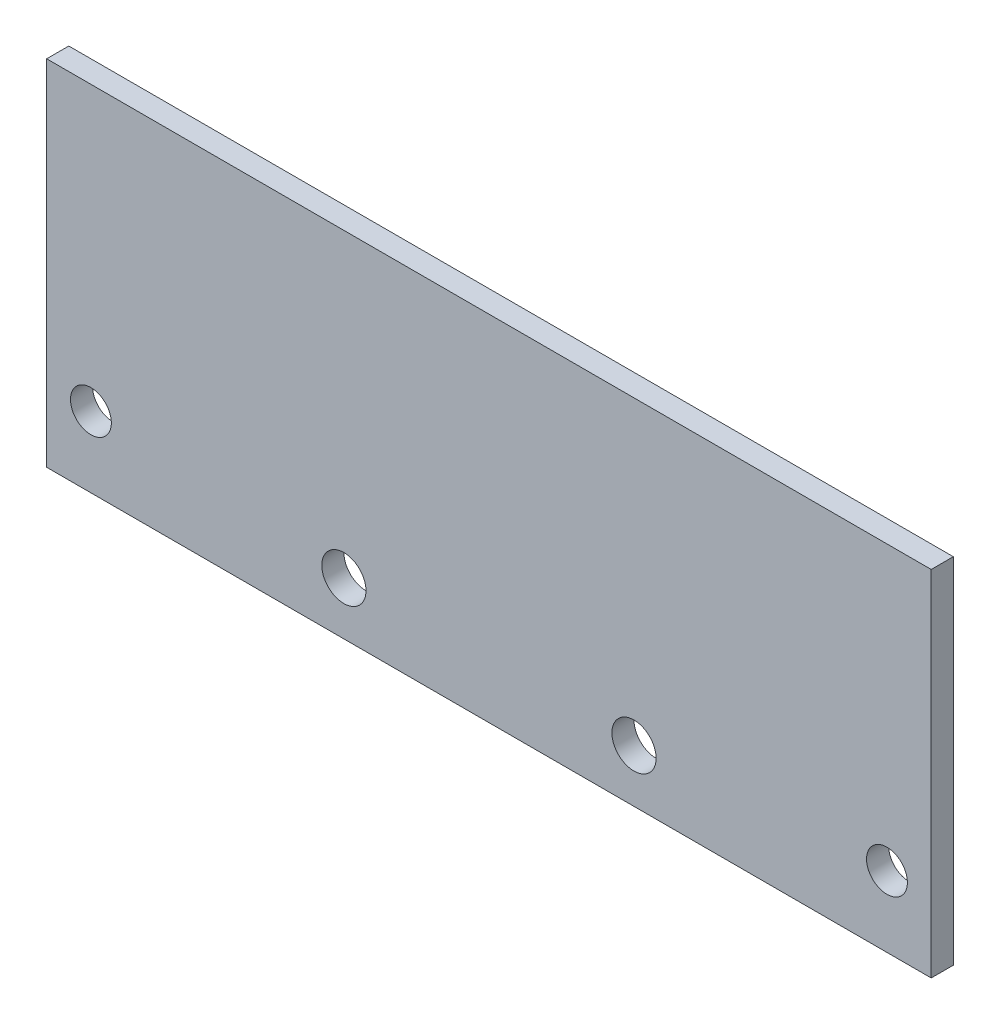
ISO-10303-21;
HEADER;
FILE_DESCRIPTION(('STEP AP214'),'2;1');
FILE_NAME('part.step','',(''),(''),'','','');
FILE_SCHEMA(('AUTOMOTIVE_DESIGN { 1 0 10303 214 1 1 1 1 }'));
ENDSEC;
DATA;
#1=APPLICATION_CONTEXT('core data for automotive mechanical design processes');
#2=APPLICATION_PROTOCOL_DEFINITION('international standard','automotive_design',2000,#1);
#3=PRODUCT_CONTEXT('',#1,'mechanical');
#4=PRODUCT('Part','Part','',(#3));
#5=PRODUCT_RELATED_PRODUCT_CATEGORY('part','',(#4));
#6=PRODUCT_DEFINITION_FORMATION('','',#4);
#7=PRODUCT_DEFINITION_CONTEXT('part definition',#1,'design');
#8=PRODUCT_DEFINITION('design','',#6,#7);
#9=PRODUCT_DEFINITION_SHAPE('','',#8);
#10=(LENGTH_UNIT() NAMED_UNIT(*) SI_UNIT(.MILLI.,.METRE.));
#11=(NAMED_UNIT(*) PLANE_ANGLE_UNIT() SI_UNIT($,.RADIAN.));
#12=(NAMED_UNIT(*) SI_UNIT($,.STERADIAN.) SOLID_ANGLE_UNIT());
#13=UNCERTAINTY_MEASURE_WITH_UNIT(LENGTH_MEASURE(1.E-05),#10,'distance_accuracy_value','');
#14=(GEOMETRIC_REPRESENTATION_CONTEXT(3) GLOBAL_UNCERTAINTY_ASSIGNED_CONTEXT((#13)) GLOBAL_UNIT_ASSIGNED_CONTEXT((#10,
#11,#12)) REPRESENTATION_CONTEXT('',''));
#15=CARTESIAN_POINT('',(0.,0.,0.));
#16=DIRECTION('',(0.,0.,1.));
#17=DIRECTION('',(1.,0.,0.));
#18=AXIS2_PLACEMENT_3D('',#15,#16,#17);
#19=CARTESIAN_POINT('',(-63.5,0.,3.175));
#20=DIRECTION('',(1.,0.,0.));
#21=DIRECTION('',(0.,0.,-1.));
#22=AXIS2_PLACEMENT_3D('',#19,#20,#21);
#23=PLANE('',#22);
#24=DIRECTION('',(0.,-1.,0.));
#25=VECTOR('',#24,1.);
#26=CARTESIAN_POINT('',(-63.5,0.,0.));
#27=LINE('',#26,#25);
#28=CARTESIAN_POINT('',(-63.5,50.8,0.));
#29=VERTEX_POINT('',#28);
#30=CARTESIAN_POINT('',(-63.5,0.,0.));
#31=VERTEX_POINT('',#30);
#32=EDGE_CURVE('E96',#29,#31,#27,.T.);
#33=ORIENTED_EDGE('',*,*,#32,.T.);
#34=DIRECTION('',(0.,0.,-1.));
#35=VECTOR('',#34,1.);
#36=CARTESIAN_POINT('',(-63.5,0.,3.175));
#37=LINE('',#36,#35);
#38=CARTESIAN_POINT('',(-63.5,0.,3.175));
#39=VERTEX_POINT('',#38);
#40=EDGE_CURVE('E11',#39,#31,#37,.T.);
#41=ORIENTED_EDGE('',*,*,#40,.F.);
#42=DIRECTION('',(0.,-1.,0.));
#43=VECTOR('',#42,1.);
#44=CARTESIAN_POINT('',(-63.5,0.,3.175));
#45=LINE('',#44,#43);
#46=CARTESIAN_POINT('',(-63.5,50.8,3.175));
#47=VERTEX_POINT('',#46);
#48=EDGE_CURVE('E84',#47,#39,#45,.T.);
#49=ORIENTED_EDGE('',*,*,#48,.F.);
#50=DIRECTION('',(0.,0.,-1.));
#51=VECTOR('',#50,1.);
#52=CARTESIAN_POINT('',(-63.5,50.8,3.175));
#53=LINE('',#52,#51);
#54=EDGE_CURVE('E92',#47,#29,#53,.T.);
#55=ORIENTED_EDGE('',*,*,#54,.T.);
#56=EDGE_LOOP('',(#33,#41,#49,#55));
#57=FACE_BOUND('',#56,.T.);
#58=ADVANCED_FACE('F33',(#57),#23,.F.);
#59=CARTESIAN_POINT('',(-63.5,0.,3.175));
#60=DIRECTION('',(0.,1.,0.));
#61=DIRECTION('',(-1.,0.,0.));
#62=AXIS2_PLACEMENT_3D('',#59,#60,#61);
#63=PLANE('',#62);
#64=DIRECTION('',(1.,0.,0.));
#65=VECTOR('',#64,1.);
#66=CARTESIAN_POINT('',(-63.5,0.,0.));
#67=LINE('',#66,#65);
#68=CARTESIAN_POINT('',(63.5,0.,0.));
#69=VERTEX_POINT('',#68);
#70=EDGE_CURVE('E88',#31,#69,#67,.T.);
#71=ORIENTED_EDGE('',*,*,#70,.T.);
#72=DIRECTION('',(0.,0.,-1.));
#73=VECTOR('',#72,1.);
#74=CARTESIAN_POINT('',(63.5,0.,3.175));
#75=LINE('',#74,#73);
#76=CARTESIAN_POINT('',(63.5,0.,3.175));
#77=VERTEX_POINT('',#76);
#78=EDGE_CURVE('E41',#77,#69,#75,.T.);
#79=ORIENTED_EDGE('',*,*,#78,.F.);
#80=DIRECTION('',(1.,0.,0.));
#81=VECTOR('',#80,1.);
#82=CARTESIAN_POINT('',(-63.5,0.,3.175));
#83=LINE('',#82,#81);
#84=EDGE_CURVE('E79',#39,#77,#83,.T.);
#85=ORIENTED_EDGE('',*,*,#84,.F.);
#86=ORIENTED_EDGE('',*,*,#40,.T.);
#87=EDGE_LOOP('',(#71,#79,#85,#86));
#88=FACE_BOUND('',#87,.T.);
#89=ADVANCED_FACE('F87',(#88),#63,.F.);
#90=CARTESIAN_POINT('',(63.5,0.,3.175));
#91=DIRECTION('',(-1.,0.,0.));
#92=DIRECTION('',(0.,0.,1.));
#93=AXIS2_PLACEMENT_3D('',#90,#91,#92);
#94=PLANE('',#93);
#95=DIRECTION('',(0.,1.,0.));
#96=VECTOR('',#95,1.);
#97=CARTESIAN_POINT('',(63.5,0.,0.));
#98=LINE('',#97,#96);
#99=CARTESIAN_POINT('',(63.5,50.8,0.));
#100=VERTEX_POINT('',#99);
#101=EDGE_CURVE('E66',#69,#100,#98,.T.);
#102=ORIENTED_EDGE('',*,*,#101,.T.);
#103=DIRECTION('',(0.,0.,-1.));
#104=VECTOR('',#103,1.);
#105=CARTESIAN_POINT('',(63.5,50.8,3.175));
#106=LINE('',#105,#104);
#107=CARTESIAN_POINT('',(63.5,50.8,3.175));
#108=VERTEX_POINT('',#107);
#109=EDGE_CURVE('E89',#108,#100,#106,.T.);
#110=ORIENTED_EDGE('',*,*,#109,.F.);
#111=DIRECTION('',(0.,1.,0.));
#112=VECTOR('',#111,1.);
#113=CARTESIAN_POINT('',(63.5,0.,3.175));
#114=LINE('',#113,#112);
#115=EDGE_CURVE('E82',#77,#108,#114,.T.);
#116=ORIENTED_EDGE('',*,*,#115,.F.);
#117=ORIENTED_EDGE('',*,*,#78,.T.);
#118=EDGE_LOOP('',(#102,#110,#116,#117));
#119=FACE_BOUND('',#118,.T.);
#120=ADVANCED_FACE('F90',(#119),#94,.F.);
#121=CARTESIAN_POINT('',(-63.5,50.8,3.175));
#122=DIRECTION('',(0.,-1.,0.));
#123=DIRECTION('',(0.,0.,-1.));
#124=AXIS2_PLACEMENT_3D('',#121,#122,#123);
#125=PLANE('',#124);
#126=DIRECTION('',(-1.,0.,0.));
#127=VECTOR('',#126,1.);
#128=CARTESIAN_POINT('',(-63.5,50.8,0.));
#129=LINE('',#128,#127);
#130=EDGE_CURVE('E72',#100,#29,#129,.T.);
#131=ORIENTED_EDGE('',*,*,#130,.T.);
#132=ORIENTED_EDGE('',*,*,#54,.F.);
#133=DIRECTION('',(-1.,0.,0.));
#134=VECTOR('',#133,1.);
#135=CARTESIAN_POINT('',(-63.5,50.8,3.175));
#136=LINE('',#135,#134);
#137=EDGE_CURVE('E49',#108,#47,#136,.T.);
#138=ORIENTED_EDGE('',*,*,#137,.F.);
#139=ORIENTED_EDGE('',*,*,#109,.T.);
#140=EDGE_LOOP('',(#131,#132,#138,#139));
#141=FACE_BOUND('',#140,.T.);
#142=ADVANCED_FACE('F104',(#141),#125,.F.);
#143=CARTESIAN_POINT('',(0.,0.,3.175));
#144=DIRECTION('',(0.,0.,-1.));
#145=DIRECTION('',(-1.,0.,0.));
#146=AXIS2_PLACEMENT_3D('',#143,#144,#145);
#147=PLANE('',#146);
#148=CARTESIAN_POINT('',(57.15,10.16,3.175));
#149=DIRECTION('',(0.,0.,-1.));
#150=DIRECTION('',(-1.,0.,0.));
#151=AXIS2_PLACEMENT_3D('',#148,#149,#150);
#152=CIRCLE('',#151,2.9337);
#153=CARTESIAN_POINT('',(54.2163,10.16,3.175));
#154=VERTEX_POINT('',#153);
#155=EDGE_CURVE('E99',#154,#154,#152,.T.);
#156=ORIENTED_EDGE('',*,*,#155,.T.);
#157=EDGE_LOOP('',(#156));
#158=FACE_BOUND('',#157,.T.);
#159=CARTESIAN_POINT('',(-57.15,10.16,3.175));
#160=DIRECTION('',(0.,0.,-1.));
#161=DIRECTION('',(-1.,0.,0.));
#162=AXIS2_PLACEMENT_3D('',#159,#160,#161);
#163=CIRCLE('',#162,2.9337);
#164=CARTESIAN_POINT('',(-60.0837,10.16,3.175));
#165=VERTEX_POINT('',#164);
#166=EDGE_CURVE('E125',#165,#165,#163,.T.);
#167=ORIENTED_EDGE('',*,*,#166,.T.);
#168=EDGE_LOOP('',(#167));
#169=FACE_BOUND('',#168,.T.);
#170=CARTESIAN_POINT('',(-20.828,7.56742452844433,3.175));
#171=DIRECTION('',(0.,0.,-1.));
#172=DIRECTION('',(-1.,0.,0.));
#173=AXIS2_PLACEMENT_3D('',#170,#171,#172);
#174=CIRCLE('',#173,3.175);
#175=CARTESIAN_POINT('',(-24.003,7.56742452844433,3.175));
#176=VERTEX_POINT('',#175);
#177=EDGE_CURVE('E119',#176,#176,#174,.T.);
#178=ORIENTED_EDGE('',*,*,#177,.T.);
#179=EDGE_LOOP('',(#178));
#180=FACE_BOUND('',#179,.T.);
#181=CARTESIAN_POINT('',(20.828,7.56742452844433,3.175));
#182=DIRECTION('',(0.,0.,-1.));
#183=DIRECTION('',(-1.,0.,0.));
#184=AXIS2_PLACEMENT_3D('',#181,#182,#183);
#185=CIRCLE('',#184,3.175);
#186=CARTESIAN_POINT('',(17.653,7.56742452844433,3.175));
#187=VERTEX_POINT('',#186);
#188=EDGE_CURVE('E113',#187,#187,#185,.T.);
#189=ORIENTED_EDGE('',*,*,#188,.T.);
#190=EDGE_LOOP('',(#189));
#191=FACE_BOUND('',#190,.T.);
#192=ORIENTED_EDGE('',*,*,#48,.T.);
#193=ORIENTED_EDGE('',*,*,#84,.T.);
#194=ORIENTED_EDGE('',*,*,#115,.T.);
#195=ORIENTED_EDGE('',*,*,#137,.T.);
#196=EDGE_LOOP('',(#192,#193,#194,#195));
#197=FACE_BOUND('',#196,.T.);
#198=ADVANCED_FACE('F80',(#158,#169,#180,#191,#197),#147,.F.);
#199=CARTESIAN_POINT('',(0.,0.,0.));
#200=DIRECTION('',(0.,0.,-1.));
#201=DIRECTION('',(-1.,0.,0.));
#202=AXIS2_PLACEMENT_3D('',#199,#200,#201);
#203=PLANE('',#202);
#204=CARTESIAN_POINT('',(57.15,10.16,0.));
#205=DIRECTION('',(0.,0.,-1.));
#206=DIRECTION('',(-1.,0.,0.));
#207=AXIS2_PLACEMENT_3D('',#204,#205,#206);
#208=CIRCLE('',#207,2.9337);
#209=CARTESIAN_POINT('',(54.2163,10.16,0.));
#210=VERTEX_POINT('',#209);
#211=EDGE_CURVE('E128',#210,#210,#208,.T.);
#212=ORIENTED_EDGE('',*,*,#211,.F.);
#213=EDGE_LOOP('',(#212));
#214=FACE_BOUND('',#213,.T.);
#215=CARTESIAN_POINT('',(-57.15,10.16,0.));
#216=DIRECTION('',(0.,0.,-1.));
#217=DIRECTION('',(-1.,0.,0.));
#218=AXIS2_PLACEMENT_3D('',#215,#216,#217);
#219=CIRCLE('',#218,2.9337);
#220=CARTESIAN_POINT('',(-60.0837,10.16,0.));
#221=VERTEX_POINT('',#220);
#222=EDGE_CURVE('E122',#221,#221,#219,.T.);
#223=ORIENTED_EDGE('',*,*,#222,.F.);
#224=EDGE_LOOP('',(#223));
#225=FACE_BOUND('',#224,.T.);
#226=CARTESIAN_POINT('',(-20.828,7.56742452844433,0.));
#227=DIRECTION('',(0.,0.,-1.));
#228=DIRECTION('',(-1.,0.,0.));
#229=AXIS2_PLACEMENT_3D('',#226,#227,#228);
#230=CIRCLE('',#229,3.175);
#231=CARTESIAN_POINT('',(-24.003,7.56742452844433,0.));
#232=VERTEX_POINT('',#231);
#233=EDGE_CURVE('E116',#232,#232,#230,.T.);
#234=ORIENTED_EDGE('',*,*,#233,.F.);
#235=EDGE_LOOP('',(#234));
#236=FACE_BOUND('',#235,.T.);
#237=CARTESIAN_POINT('',(20.828,7.56742452844433,0.));
#238=DIRECTION('',(0.,0.,-1.));
#239=DIRECTION('',(-1.,0.,0.));
#240=AXIS2_PLACEMENT_3D('',#237,#238,#239);
#241=CIRCLE('',#240,3.175);
#242=CARTESIAN_POINT('',(17.653,7.56742452844433,0.));
#243=VERTEX_POINT('',#242);
#244=EDGE_CURVE('E110',#243,#243,#241,.T.);
#245=ORIENTED_EDGE('',*,*,#244,.F.);
#246=EDGE_LOOP('',(#245));
#247=FACE_BOUND('',#246,.T.);
#248=ORIENTED_EDGE('',*,*,#32,.F.);
#249=ORIENTED_EDGE('',*,*,#130,.F.);
#250=ORIENTED_EDGE('',*,*,#101,.F.);
#251=ORIENTED_EDGE('',*,*,#70,.F.);
#252=EDGE_LOOP('',(#248,#249,#250,#251));
#253=FACE_BOUND('',#252,.T.);
#254=ADVANCED_FACE('F107',(#214,#225,#236,#247,#253),#203,.T.);
#255=CARTESIAN_POINT('',(20.828,7.56742452844433,3.175));
#256=DIRECTION('',(0.,0.,-1.));
#257=DIRECTION('',(-1.,0.,0.));
#258=AXIS2_PLACEMENT_3D('',#255,#256,#257);
#259=CYLINDRICAL_SURFACE('',#258,3.175);
#260=ORIENTED_EDGE('',*,*,#188,.F.);
#261=EDGE_LOOP('',(#260));
#262=FACE_BOUND('',#261,.T.);
#263=ORIENTED_EDGE('',*,*,#244,.T.);
#264=EDGE_LOOP('',(#263));
#265=FACE_BOUND('',#264,.T.);
#266=ADVANCED_FACE('F145',(#262,#265),#259,.F.);
#267=CARTESIAN_POINT('',(-20.828,7.56742452844433,3.175));
#268=DIRECTION('',(0.,0.,-1.));
#269=DIRECTION('',(-1.,0.,0.));
#270=AXIS2_PLACEMENT_3D('',#267,#268,#269);
#271=CYLINDRICAL_SURFACE('',#270,3.175);
#272=ORIENTED_EDGE('',*,*,#177,.F.);
#273=EDGE_LOOP('',(#272));
#274=FACE_BOUND('',#273,.T.);
#275=ORIENTED_EDGE('',*,*,#233,.T.);
#276=EDGE_LOOP('',(#275));
#277=FACE_BOUND('',#276,.T.);
#278=ADVANCED_FACE('F154',(#274,#277),#271,.F.);
#279=CARTESIAN_POINT('',(-57.15,10.16,3.175));
#280=DIRECTION('',(0.,0.,-1.));
#281=DIRECTION('',(-1.,0.,0.));
#282=AXIS2_PLACEMENT_3D('',#279,#280,#281);
#283=CYLINDRICAL_SURFACE('',#282,2.9337);
#284=ORIENTED_EDGE('',*,*,#166,.F.);
#285=EDGE_LOOP('',(#284));
#286=FACE_BOUND('',#285,.T.);
#287=ORIENTED_EDGE('',*,*,#222,.T.);
#288=EDGE_LOOP('',(#287));
#289=FACE_BOUND('',#288,.T.);
#290=ADVANCED_FACE('F139',(#286,#289),#283,.F.);
#291=CARTESIAN_POINT('',(57.15,10.16,3.175));
#292=DIRECTION('',(0.,0.,-1.));
#293=DIRECTION('',(-1.,0.,0.));
#294=AXIS2_PLACEMENT_3D('',#291,#292,#293);
#295=CYLINDRICAL_SURFACE('',#294,2.9337);
#296=ORIENTED_EDGE('',*,*,#155,.F.);
#297=EDGE_LOOP('',(#296));
#298=FACE_BOUND('',#297,.T.);
#299=ORIENTED_EDGE('',*,*,#211,.T.);
#300=EDGE_LOOP('',(#299));
#301=FACE_BOUND('',#300,.T.);
#302=ADVANCED_FACE('F136',(#298,#301),#295,.F.);
#303=CLOSED_SHELL('',(#58,#89,#120,#142,#198,#254,#266,#278,#290,#302));
#304=MANIFOLD_SOLID_BREP('B2',#303);
#305=ADVANCED_BREP_SHAPE_REPRESENTATION('',(#18,#304),#14);
#306=SHAPE_DEFINITION_REPRESENTATION(#9,#305);
ENDSEC;
END-ISO-10303-21;
